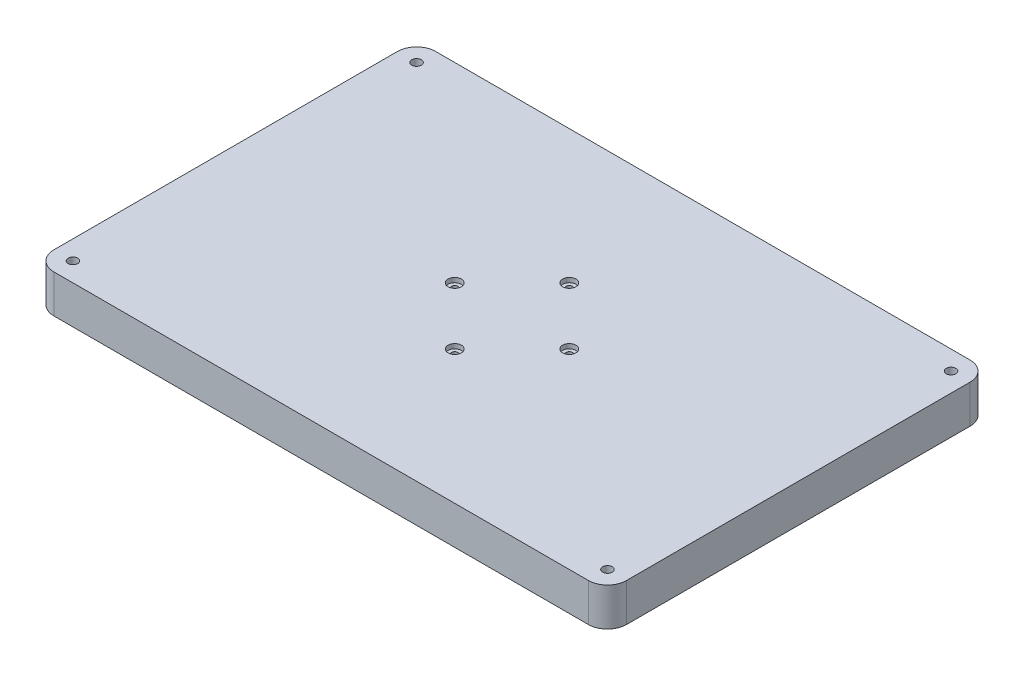
ISO-10303-21;
HEADER;
FILE_DESCRIPTION(('STEP AP214'),'2;1');
FILE_NAME('part.step','',(''),(''),'','','');
FILE_SCHEMA(('AUTOMOTIVE_DESIGN { 1 0 10303 214 1 1 1 1 }'));
ENDSEC;
DATA;
#1=APPLICATION_CONTEXT('core data for automotive mechanical design processes');
#2=APPLICATION_PROTOCOL_DEFINITION('international standard','automotive_design',2000,#1);
#3=PRODUCT_CONTEXT('',#1,'mechanical');
#4=PRODUCT('Part','Part','',(#3));
#5=PRODUCT_RELATED_PRODUCT_CATEGORY('part','',(#4));
#6=PRODUCT_DEFINITION_FORMATION('','',#4);
#7=PRODUCT_DEFINITION_CONTEXT('part definition',#1,'design');
#8=PRODUCT_DEFINITION('design','',#6,#7);
#9=PRODUCT_DEFINITION_SHAPE('','',#8);
#10=(LENGTH_UNIT() NAMED_UNIT(*) SI_UNIT(.MILLI.,.METRE.));
#11=(NAMED_UNIT(*) PLANE_ANGLE_UNIT() SI_UNIT($,.RADIAN.));
#12=(NAMED_UNIT(*) SI_UNIT($,.STERADIAN.) SOLID_ANGLE_UNIT());
#13=UNCERTAINTY_MEASURE_WITH_UNIT(LENGTH_MEASURE(1.E-05),#10,'distance_accuracy_value','');
#14=(GEOMETRIC_REPRESENTATION_CONTEXT(3) GLOBAL_UNCERTAINTY_ASSIGNED_CONTEXT((#13)) GLOBAL_UNIT_ASSIGNED_CONTEXT((#10,
#11,#12)) REPRESENTATION_CONTEXT('',''));
#15=CARTESIAN_POINT('',(0.,0.,0.));
#16=DIRECTION('',(0.,0.,1.));
#17=DIRECTION('',(1.,0.,0.));
#18=AXIS2_PLACEMENT_3D('',#15,#16,#17);
#19=CARTESIAN_POINT('',(-150.,20.,-100.));
#20=DIRECTION('',(1.,0.,0.));
#21=DIRECTION('',(0.,0.,-1.));
#22=AXIS2_PLACEMENT_3D('',#19,#20,#21);
#23=PLANE('',#22);
#24=DIRECTION('',(0.,0.,1.));
#25=VECTOR('',#24,1.);
#26=CARTESIAN_POINT('',(-150.,20.,-100.));
#27=LINE('',#26,#25);
#28=CARTESIAN_POINT('',(-150.,20.,-90.));
#29=VERTEX_POINT('',#28);
#30=CARTESIAN_POINT('',(-150.,20.,90.));
#31=VERTEX_POINT('',#30);
#32=EDGE_CURVE('E217',#29,#31,#27,.T.);
#33=ORIENTED_EDGE('',*,*,#32,.F.);
#34=DIRECTION('',(0.,-1.,0.));
#35=VECTOR('',#34,1.);
#36=CARTESIAN_POINT('',(-150.,20.,-90.));
#37=LINE('',#36,#35);
#38=CARTESIAN_POINT('',(-150.,0.,-90.));
#39=VERTEX_POINT('',#38);
#40=EDGE_CURVE('E239',#29,#39,#37,.T.);
#41=ORIENTED_EDGE('',*,*,#40,.T.);
#42=DIRECTION('',(0.,0.,1.));
#43=VECTOR('',#42,1.);
#44=CARTESIAN_POINT('',(-150.,0.,-100.));
#45=LINE('',#44,#43);
#46=CARTESIAN_POINT('',(-150.,0.,90.));
#47=VERTEX_POINT('',#46);
#48=EDGE_CURVE('E216',#39,#47,#45,.T.);
#49=ORIENTED_EDGE('',*,*,#48,.T.);
#50=DIRECTION('',(0.,-1.,0.));
#51=VECTOR('',#50,1.);
#52=CARTESIAN_POINT('',(-150.,20.,90.));
#53=LINE('',#52,#51);
#54=EDGE_CURVE('E228',#47,#31,#53,.F.);
#55=ORIENTED_EDGE('',*,*,#54,.T.);
#56=EDGE_LOOP('',(#33,#41,#49,#55));
#57=FACE_BOUND('',#56,.T.);
#58=ADVANCED_FACE('F35',(#57),#23,.F.);
#59=CARTESIAN_POINT('',(150.,20.,100.));
#60=DIRECTION('',(0.,0.,-1.));
#61=DIRECTION('',(-1.,0.,0.));
#62=AXIS2_PLACEMENT_3D('',#59,#60,#61);
#63=PLANE('',#62);
#64=DIRECTION('',(1.,0.,0.));
#65=VECTOR('',#64,1.);
#66=CARTESIAN_POINT('',(150.,20.,100.));
#67=LINE('',#66,#65);
#68=CARTESIAN_POINT('',(-140.,20.,100.));
#69=VERTEX_POINT('',#68);
#70=CARTESIAN_POINT('',(140.,20.,100.));
#71=VERTEX_POINT('',#70);
#72=EDGE_CURVE('E220',#69,#71,#67,.T.);
#73=ORIENTED_EDGE('',*,*,#72,.F.);
#74=DIRECTION('',(0.,-1.,0.));
#75=VECTOR('',#74,1.);
#76=CARTESIAN_POINT('',(-140.,20.,100.));
#77=LINE('',#76,#75);
#78=CARTESIAN_POINT('',(-140.,0.,100.));
#79=VERTEX_POINT('',#78);
#80=EDGE_CURVE('E264',#69,#79,#77,.T.);
#81=ORIENTED_EDGE('',*,*,#80,.T.);
#82=DIRECTION('',(1.,0.,0.));
#83=VECTOR('',#82,1.);
#84=CARTESIAN_POINT('',(150.,0.,100.));
#85=LINE('',#84,#83);
#86=CARTESIAN_POINT('',(140.,0.,100.));
#87=VERTEX_POINT('',#86);
#88=EDGE_CURVE('E231',#79,#87,#85,.T.);
#89=ORIENTED_EDGE('',*,*,#88,.T.);
#90=DIRECTION('',(0.,-1.,0.));
#91=VECTOR('',#90,1.);
#92=CARTESIAN_POINT('',(140.,20.,100.));
#93=LINE('',#92,#91);
#94=EDGE_CURVE('E262',#87,#71,#93,.F.);
#95=ORIENTED_EDGE('',*,*,#94,.T.);
#96=EDGE_LOOP('',(#73,#81,#89,#95));
#97=FACE_BOUND('',#96,.T.);
#98=ADVANCED_FACE('F270',(#97),#63,.F.);
#99=CARTESIAN_POINT('',(150.,20.,-100.));
#100=DIRECTION('',(-1.,0.,0.));
#101=DIRECTION('',(0.,0.,1.));
#102=AXIS2_PLACEMENT_3D('',#99,#100,#101);
#103=PLANE('',#102);
#104=DIRECTION('',(0.,0.,-1.));
#105=VECTOR('',#104,1.);
#106=CARTESIAN_POINT('',(150.,20.,-100.));
#107=LINE('',#106,#105);
#108=CARTESIAN_POINT('',(150.,20.,90.));
#109=VERTEX_POINT('',#108);
#110=CARTESIAN_POINT('',(150.,20.,-90.));
#111=VERTEX_POINT('',#110);
#112=EDGE_CURVE('E223',#109,#111,#107,.T.);
#113=ORIENTED_EDGE('',*,*,#112,.F.);
#114=DIRECTION('',(0.,-1.,0.));
#115=VECTOR('',#114,1.);
#116=CARTESIAN_POINT('',(150.,20.,90.));
#117=LINE('',#116,#115);
#118=CARTESIAN_POINT('',(150.,0.,90.));
#119=VERTEX_POINT('',#118);
#120=EDGE_CURVE('E11',#109,#119,#117,.T.);
#121=ORIENTED_EDGE('',*,*,#120,.T.);
#122=DIRECTION('',(0.,0.,-1.));
#123=VECTOR('',#122,1.);
#124=CARTESIAN_POINT('',(150.,0.,-100.));
#125=LINE('',#124,#123);
#126=CARTESIAN_POINT('',(150.,0.,-90.));
#127=VERTEX_POINT('',#126);
#128=EDGE_CURVE('E234',#119,#127,#125,.T.);
#129=ORIENTED_EDGE('',*,*,#128,.T.);
#130=DIRECTION('',(0.,-1.,0.));
#131=VECTOR('',#130,1.);
#132=CARTESIAN_POINT('',(150.,20.,-90.));
#133=LINE('',#132,#131);
#134=EDGE_CURVE('E43',#127,#111,#133,.F.);
#135=ORIENTED_EDGE('',*,*,#134,.T.);
#136=EDGE_LOOP('',(#113,#121,#129,#135));
#137=FACE_BOUND('',#136,.T.);
#138=ADVANCED_FACE('F281',(#137),#103,.F.);
#139=CARTESIAN_POINT('',(150.,20.,-100.));
#140=DIRECTION('',(0.,0.,1.));
#141=DIRECTION('',(1.,0.,0.));
#142=AXIS2_PLACEMENT_3D('',#139,#140,#141);
#143=PLANE('',#142);
#144=DIRECTION('',(-1.,0.,0.));
#145=VECTOR('',#144,1.);
#146=CARTESIAN_POINT('',(150.,0.,-100.));
#147=LINE('',#146,#145);
#148=CARTESIAN_POINT('',(140.,0.,-100.));
#149=VERTEX_POINT('',#148);
#150=CARTESIAN_POINT('',(-140.,0.,-100.));
#151=VERTEX_POINT('',#150);
#152=EDGE_CURVE('E221',#149,#151,#147,.T.);
#153=ORIENTED_EDGE('',*,*,#152,.T.);
#154=DIRECTION('',(0.,-1.,0.));
#155=VECTOR('',#154,1.);
#156=CARTESIAN_POINT('',(-140.,20.,-100.));
#157=LINE('',#156,#155);
#158=CARTESIAN_POINT('',(-140.,20.,-100.));
#159=VERTEX_POINT('',#158);
#160=EDGE_CURVE('E253',#151,#159,#157,.F.);
#161=ORIENTED_EDGE('',*,*,#160,.T.);
#162=DIRECTION('',(-1.,0.,0.));
#163=VECTOR('',#162,1.);
#164=CARTESIAN_POINT('',(150.,20.,-100.));
#165=LINE('',#164,#163);
#166=CARTESIAN_POINT('',(140.,20.,-100.));
#167=VERTEX_POINT('',#166);
#168=EDGE_CURVE('E225',#167,#159,#165,.T.);
#169=ORIENTED_EDGE('',*,*,#168,.F.);
#170=DIRECTION('',(0.,-1.,0.));
#171=VECTOR('',#170,1.);
#172=CARTESIAN_POINT('',(140.,20.,-100.));
#173=LINE('',#172,#171);
#174=EDGE_CURVE('E250',#167,#149,#173,.T.);
#175=ORIENTED_EDGE('',*,*,#174,.T.);
#176=EDGE_LOOP('',(#153,#161,#169,#175));
#177=FACE_BOUND('',#176,.T.);
#178=ADVANCED_FACE('F289',(#177),#143,.F.);
#179=CARTESIAN_POINT('',(0.,20.,0.));
#180=DIRECTION('',(0.,-1.,0.));
#181=DIRECTION('',(0.,0.,-1.));
#182=AXIS2_PLACEMENT_3D('',#179,#180,#181);
#183=PLANE('',#182);
#184=CARTESIAN_POINT('',(-140.,20.,-90.));
#185=DIRECTION('',(0.,1.,0.));
#186=DIRECTION('',(0.,0.,1.));
#187=AXIS2_PLACEMENT_3D('',#184,#185,#186);
#188=CIRCLE('',#187,2.5);
#189=CARTESIAN_POINT('',(-140.,20.,-87.5));
#190=VERTEX_POINT('',#189);
#191=EDGE_CURVE('E144',#190,#190,#188,.T.);
#192=ORIENTED_EDGE('',*,*,#191,.F.);
#193=EDGE_LOOP('',(#192));
#194=FACE_BOUND('',#193,.T.);
#195=CARTESIAN_POINT('',(140.,20.,-90.));
#196=DIRECTION('',(0.,1.,0.));
#197=DIRECTION('',(0.,0.,1.));
#198=AXIS2_PLACEMENT_3D('',#195,#196,#197);
#199=CIRCLE('',#198,2.5);
#200=CARTESIAN_POINT('',(140.,20.,-87.5));
#201=VERTEX_POINT('',#200);
#202=EDGE_CURVE('E150',#201,#201,#199,.T.);
#203=ORIENTED_EDGE('',*,*,#202,.F.);
#204=EDGE_LOOP('',(#203));
#205=FACE_BOUND('',#204,.T.);
#206=CARTESIAN_POINT('',(140.,20.,90.));
#207=DIRECTION('',(0.,1.,0.));
#208=DIRECTION('',(0.,0.,1.));
#209=AXIS2_PLACEMENT_3D('',#206,#207,#208);
#210=CIRCLE('',#209,2.5);
#211=CARTESIAN_POINT('',(140.,20.,92.5));
#212=VERTEX_POINT('',#211);
#213=EDGE_CURVE('E156',#212,#212,#210,.T.);
#214=ORIENTED_EDGE('',*,*,#213,.F.);
#215=EDGE_LOOP('',(#214));
#216=FACE_BOUND('',#215,.T.);
#217=CARTESIAN_POINT('',(-140.,20.,90.));
#218=DIRECTION('',(0.,1.,0.));
#219=DIRECTION('',(0.,0.,1.));
#220=AXIS2_PLACEMENT_3D('',#217,#218,#219);
#221=CIRCLE('',#220,2.5);
#222=CARTESIAN_POINT('',(-140.,20.,92.5));
#223=VERTEX_POINT('',#222);
#224=EDGE_CURVE('E162',#223,#223,#221,.T.);
#225=ORIENTED_EDGE('',*,*,#224,.F.);
#226=EDGE_LOOP('',(#225));
#227=FACE_BOUND('',#226,.T.);
#228=CARTESIAN_POINT('',(-30.,20.,0.));
#229=DIRECTION('',(0.,1.,0.));
#230=DIRECTION('',(0.,0.,1.));
#231=AXIS2_PLACEMENT_3D('',#228,#229,#230);
#232=CIRCLE('',#231,3.5);
#233=CARTESIAN_POINT('',(-30.,20.,3.5));
#234=VERTEX_POINT('',#233);
#235=EDGE_CURVE('E168',#234,#234,#232,.T.);
#236=ORIENTED_EDGE('',*,*,#235,.F.);
#237=EDGE_LOOP('',(#236));
#238=FACE_BOUND('',#237,.T.);
#239=CARTESIAN_POINT('',(0.,20.,30.));
#240=DIRECTION('',(0.,1.,0.));
#241=DIRECTION('',(0.,0.,1.));
#242=AXIS2_PLACEMENT_3D('',#239,#240,#241);
#243=CIRCLE('',#242,3.5);
#244=CARTESIAN_POINT('',(0.,20.,33.5));
#245=VERTEX_POINT('',#244);
#246=EDGE_CURVE('E180',#245,#245,#243,.T.);
#247=ORIENTED_EDGE('',*,*,#246,.F.);
#248=EDGE_LOOP('',(#247));
#249=FACE_BOUND('',#248,.T.);
#250=CARTESIAN_POINT('',(30.,20.,0.));
#251=DIRECTION('',(0.,1.,0.));
#252=DIRECTION('',(0.,0.,1.));
#253=AXIS2_PLACEMENT_3D('',#250,#251,#252);
#254=CIRCLE('',#253,3.5);
#255=CARTESIAN_POINT('',(30.,20.,3.5));
#256=VERTEX_POINT('',#255);
#257=EDGE_CURVE('E192',#256,#256,#254,.T.);
#258=ORIENTED_EDGE('',*,*,#257,.F.);
#259=EDGE_LOOP('',(#258));
#260=FACE_BOUND('',#259,.T.);
#261=CARTESIAN_POINT('',(0.,20.,-30.));
#262=DIRECTION('',(0.,1.,0.));
#263=DIRECTION('',(0.,0.,1.));
#264=AXIS2_PLACEMENT_3D('',#261,#262,#263);
#265=CIRCLE('',#264,3.5);
#266=CARTESIAN_POINT('',(0.,20.,-26.5));
#267=VERTEX_POINT('',#266);
#268=EDGE_CURVE('E204',#267,#267,#265,.T.);
#269=ORIENTED_EDGE('',*,*,#268,.F.);
#270=EDGE_LOOP('',(#269));
#271=FACE_BOUND('',#270,.T.);
#272=ORIENTED_EDGE('',*,*,#168,.T.);
#273=CARTESIAN_POINT('',(-140.,20.,-90.));
#274=DIRECTION('',(0.,-1.,0.));
#275=DIRECTION('',(0.,0.,-1.));
#276=AXIS2_PLACEMENT_3D('',#273,#274,#275);
#277=CIRCLE('',#276,10.);
#278=EDGE_CURVE('E260',#159,#29,#277,.F.);
#279=ORIENTED_EDGE('',*,*,#278,.T.);
#280=ORIENTED_EDGE('',*,*,#32,.T.);
#281=CARTESIAN_POINT('',(-140.,20.,90.));
#282=DIRECTION('',(0.,-1.,0.));
#283=DIRECTION('',(0.,0.,-1.));
#284=AXIS2_PLACEMENT_3D('',#281,#282,#283);
#285=CIRCLE('',#284,10.);
#286=EDGE_CURVE('E258',#31,#69,#285,.F.);
#287=ORIENTED_EDGE('',*,*,#286,.T.);
#288=ORIENTED_EDGE('',*,*,#72,.T.);
#289=CARTESIAN_POINT('',(140.,20.,90.));
#290=DIRECTION('',(0.,-1.,0.));
#291=DIRECTION('',(0.,0.,-1.));
#292=AXIS2_PLACEMENT_3D('',#289,#290,#291);
#293=CIRCLE('',#292,10.);
#294=EDGE_CURVE('E56',#71,#109,#293,.F.);
#295=ORIENTED_EDGE('',*,*,#294,.T.);
#296=ORIENTED_EDGE('',*,*,#112,.T.);
#297=CARTESIAN_POINT('',(140.,20.,-90.));
#298=DIRECTION('',(0.,-1.,0.));
#299=DIRECTION('',(0.,0.,-1.));
#300=AXIS2_PLACEMENT_3D('',#297,#298,#299);
#301=CIRCLE('',#300,10.);
#302=EDGE_CURVE('E255',#111,#167,#301,.F.);
#303=ORIENTED_EDGE('',*,*,#302,.T.);
#304=EDGE_LOOP('',(#272,#279,#280,#287,#288,#295,#296,#303));
#305=FACE_BOUND('',#304,.T.);
#306=ADVANCED_FACE('F283',(#194,#205,#216,#227,#238,#249,#260,#271,#305),#183,.F.);
#307=CARTESIAN_POINT('',(0.,0.,0.));
#308=DIRECTION('',(0.,-1.,0.));
#309=DIRECTION('',(0.,0.,-1.));
#310=AXIS2_PLACEMENT_3D('',#307,#308,#309);
#311=PLANE('',#310);
#312=CARTESIAN_POINT('',(-129.008456627389,0.,60.2814178710673));
#313=DIRECTION('',(0.,-1.,0.));
#314=DIRECTION('',(0.,0.,-1.));
#315=AXIS2_PLACEMENT_3D('',#312,#313,#314);
#316=CIRCLE('',#315,1.);
#317=CARTESIAN_POINT('',(-129.008456627389,0.,59.2814178710673));
#318=VERTEX_POINT('',#317);
#319=EDGE_CURVE('E122',#318,#318,#316,.T.);
#320=ORIENTED_EDGE('',*,*,#319,.F.);
#321=EDGE_LOOP('',(#320));
#322=FACE_BOUND('',#321,.T.);
#323=CARTESIAN_POINT('',(-123.889747091653,0.,7.88324220922874));
#324=DIRECTION('',(0.,-1.,0.));
#325=DIRECTION('',(0.,0.,-1.));
#326=AXIS2_PLACEMENT_3D('',#323,#324,#325);
#327=CIRCLE('',#326,1.);
#328=CARTESIAN_POINT('',(-123.889747091653,0.,6.88324220922874));
#329=VERTEX_POINT('',#328);
#330=EDGE_CURVE('E121',#329,#329,#327,.T.);
#331=ORIENTED_EDGE('',*,*,#330,.F.);
#332=EDGE_LOOP('',(#331));
#333=FACE_BOUND('',#332,.T.);
#334=CARTESIAN_POINT('',(-95.9897488701489,0.,7.89320413894884));
#335=DIRECTION('',(0.,-1.,0.));
#336=DIRECTION('',(0.,0.,-1.));
#337=AXIS2_PLACEMENT_3D('',#334,#335,#336);
#338=CIRCLE('',#337,1.);
#339=CARTESIAN_POINT('',(-95.9897488701489,0.,6.89320413894884));
#340=VERTEX_POINT('',#339);
#341=EDGE_CURVE('E132',#340,#340,#338,.T.);
#342=ORIENTED_EDGE('',*,*,#341,.F.);
#343=EDGE_LOOP('',(#342));
#344=FACE_BOUND('',#343,.T.);
#345=CARTESIAN_POINT('',(-80.7078884128285,0.,58.6986638944022));
#346=DIRECTION('',(0.,-1.,0.));
#347=DIRECTION('',(0.,0.,-1.));
#348=AXIS2_PLACEMENT_3D('',#345,#346,#347);
#349=CIRCLE('',#348,1.);
#350=CARTESIAN_POINT('',(-80.7078884128285,0.,57.6986638944022));
#351=VERTEX_POINT('',#350);
#352=EDGE_CURVE('E138',#351,#351,#349,.T.);
#353=ORIENTED_EDGE('',*,*,#352,.F.);
#354=EDGE_LOOP('',(#353));
#355=FACE_BOUND('',#354,.T.);
#356=CARTESIAN_POINT('',(-140.,0.,-90.));
#357=DIRECTION('',(0.,1.,0.));
#358=DIRECTION('',(0.,0.,1.));
#359=AXIS2_PLACEMENT_3D('',#356,#357,#358);
#360=CIRCLE('',#359,2.5);
#361=CARTESIAN_POINT('',(-140.,0.,-87.5));
#362=VERTEX_POINT('',#361);
#363=EDGE_CURVE('E147',#362,#362,#360,.T.);
#364=ORIENTED_EDGE('',*,*,#363,.T.);
#365=EDGE_LOOP('',(#364));
#366=FACE_BOUND('',#365,.T.);
#367=CARTESIAN_POINT('',(140.,0.,-90.));
#368=DIRECTION('',(0.,1.,0.));
#369=DIRECTION('',(0.,0.,1.));
#370=AXIS2_PLACEMENT_3D('',#367,#368,#369);
#371=CIRCLE('',#370,2.5);
#372=CARTESIAN_POINT('',(140.,0.,-87.5));
#373=VERTEX_POINT('',#372);
#374=EDGE_CURVE('E153',#373,#373,#371,.T.);
#375=ORIENTED_EDGE('',*,*,#374,.T.);
#376=EDGE_LOOP('',(#375));
#377=FACE_BOUND('',#376,.T.);
#378=CARTESIAN_POINT('',(140.,0.,90.));
#379=DIRECTION('',(0.,1.,0.));
#380=DIRECTION('',(0.,0.,1.));
#381=AXIS2_PLACEMENT_3D('',#378,#379,#380);
#382=CIRCLE('',#381,2.5);
#383=CARTESIAN_POINT('',(140.,0.,92.5));
#384=VERTEX_POINT('',#383);
#385=EDGE_CURVE('E159',#384,#384,#382,.T.);
#386=ORIENTED_EDGE('',*,*,#385,.T.);
#387=EDGE_LOOP('',(#386));
#388=FACE_BOUND('',#387,.T.);
#389=CARTESIAN_POINT('',(-140.,0.,90.));
#390=DIRECTION('',(0.,1.,0.));
#391=DIRECTION('',(0.,0.,1.));
#392=AXIS2_PLACEMENT_3D('',#389,#390,#391);
#393=CIRCLE('',#392,2.5);
#394=CARTESIAN_POINT('',(-140.,0.,92.5));
#395=VERTEX_POINT('',#394);
#396=EDGE_CURVE('E165',#395,#395,#393,.T.);
#397=ORIENTED_EDGE('',*,*,#396,.T.);
#398=EDGE_LOOP('',(#397));
#399=FACE_BOUND('',#398,.T.);
#400=CARTESIAN_POINT('',(-30.,0.,0.));
#401=DIRECTION('',(0.,1.,0.));
#402=DIRECTION('',(0.,0.,1.));
#403=AXIS2_PLACEMENT_3D('',#400,#401,#402);
#404=CIRCLE('',#403,1.69999999999999);
#405=CARTESIAN_POINT('',(-30.,0.,1.69999999999999));
#406=VERTEX_POINT('',#405);
#407=EDGE_CURVE('E177',#406,#406,#404,.T.);
#408=ORIENTED_EDGE('',*,*,#407,.T.);
#409=EDGE_LOOP('',(#408));
#410=FACE_BOUND('',#409,.T.);
#411=CARTESIAN_POINT('',(0.,0.,30.));
#412=DIRECTION('',(0.,1.,0.));
#413=DIRECTION('',(0.,0.,1.));
#414=AXIS2_PLACEMENT_3D('',#411,#412,#413);
#415=CIRCLE('',#414,1.69999999999999);
#416=CARTESIAN_POINT('',(0.,0.,31.7));
#417=VERTEX_POINT('',#416);
#418=EDGE_CURVE('E189',#417,#417,#415,.T.);
#419=ORIENTED_EDGE('',*,*,#418,.T.);
#420=EDGE_LOOP('',(#419));
#421=FACE_BOUND('',#420,.T.);
#422=CARTESIAN_POINT('',(30.,0.,0.));
#423=DIRECTION('',(0.,1.,0.));
#424=DIRECTION('',(0.,0.,1.));
#425=AXIS2_PLACEMENT_3D('',#422,#423,#424);
#426=CIRCLE('',#425,1.69999999999999);
#427=CARTESIAN_POINT('',(30.,0.,1.69999999999999));
#428=VERTEX_POINT('',#427);
#429=EDGE_CURVE('E201',#428,#428,#426,.T.);
#430=ORIENTED_EDGE('',*,*,#429,.T.);
#431=EDGE_LOOP('',(#430));
#432=FACE_BOUND('',#431,.T.);
#433=CARTESIAN_POINT('',(0.,0.,-30.));
#434=DIRECTION('',(0.,1.,0.));
#435=DIRECTION('',(0.,0.,1.));
#436=AXIS2_PLACEMENT_3D('',#433,#434,#435);
#437=CIRCLE('',#436,1.69999999999999);
#438=CARTESIAN_POINT('',(0.,0.,-28.3));
#439=VERTEX_POINT('',#438);
#440=EDGE_CURVE('E213',#439,#439,#437,.T.);
#441=ORIENTED_EDGE('',*,*,#440,.T.);
#442=EDGE_LOOP('',(#441));
#443=FACE_BOUND('',#442,.T.);
#444=ORIENTED_EDGE('',*,*,#48,.F.);
#445=CARTESIAN_POINT('',(-140.,0.,-90.));
#446=DIRECTION('',(0.,-1.,0.));
#447=DIRECTION('',(0.,0.,-1.));
#448=AXIS2_PLACEMENT_3D('',#445,#446,#447);
#449=CIRCLE('',#448,10.);
#450=EDGE_CURVE('E248',#39,#151,#449,.T.);
#451=ORIENTED_EDGE('',*,*,#450,.T.);
#452=ORIENTED_EDGE('',*,*,#152,.F.);
#453=CARTESIAN_POINT('',(140.,0.,-90.));
#454=DIRECTION('',(0.,-1.,0.));
#455=DIRECTION('',(0.,0.,-1.));
#456=AXIS2_PLACEMENT_3D('',#453,#454,#455);
#457=CIRCLE('',#456,10.);
#458=EDGE_CURVE('E242',#149,#127,#457,.T.);
#459=ORIENTED_EDGE('',*,*,#458,.T.);
#460=ORIENTED_EDGE('',*,*,#128,.F.);
#461=CARTESIAN_POINT('',(140.,0.,90.));
#462=DIRECTION('',(0.,-1.,0.));
#463=DIRECTION('',(0.,0.,-1.));
#464=AXIS2_PLACEMENT_3D('',#461,#462,#463);
#465=CIRCLE('',#464,10.);
#466=EDGE_CURVE('E244',#119,#87,#465,.T.);
#467=ORIENTED_EDGE('',*,*,#466,.T.);
#468=ORIENTED_EDGE('',*,*,#88,.F.);
#469=CARTESIAN_POINT('',(-140.,0.,90.));
#470=DIRECTION('',(0.,-1.,0.));
#471=DIRECTION('',(0.,0.,-1.));
#472=AXIS2_PLACEMENT_3D('',#469,#470,#471);
#473=CIRCLE('',#472,10.);
#474=EDGE_CURVE('E246',#79,#47,#473,.T.);
#475=ORIENTED_EDGE('',*,*,#474,.T.);
#476=EDGE_LOOP('',(#444,#451,#452,#459,#460,#467,#468,#475));
#477=FACE_BOUND('',#476,.T.);
#478=ADVANCED_FACE('F276',(#322,#333,#344,#355,#366,#377,#388,#399,#410,#421,#432,#443,#477),
#311,.T.);
#479=CARTESIAN_POINT('',(-140.,20.,-90.));
#480=DIRECTION('',(0.,-1.,0.));
#481=DIRECTION('',(0.,0.,-1.));
#482=AXIS2_PLACEMENT_3D('',#479,#480,#481);
#483=CYLINDRICAL_SURFACE('',#482,10.);
#484=ORIENTED_EDGE('',*,*,#278,.F.);
#485=ORIENTED_EDGE('',*,*,#160,.F.);
#486=ORIENTED_EDGE('',*,*,#450,.F.);
#487=ORIENTED_EDGE('',*,*,#40,.F.);
#488=EDGE_LOOP('',(#484,#485,#486,#487));
#489=FACE_BOUND('',#488,.T.);
#490=ADVANCED_FACE('F294',(#489),#483,.T.);
#491=CARTESIAN_POINT('',(-140.,20.,90.));
#492=DIRECTION('',(0.,-1.,0.));
#493=DIRECTION('',(0.,0.,-1.));
#494=AXIS2_PLACEMENT_3D('',#491,#492,#493);
#495=CYLINDRICAL_SURFACE('',#494,10.);
#496=ORIENTED_EDGE('',*,*,#286,.F.);
#497=ORIENTED_EDGE('',*,*,#54,.F.);
#498=ORIENTED_EDGE('',*,*,#474,.F.);
#499=ORIENTED_EDGE('',*,*,#80,.F.);
#500=EDGE_LOOP('',(#496,#497,#498,#499));
#501=FACE_BOUND('',#500,.T.);
#502=ADVANCED_FACE('F298',(#501),#495,.T.);
#503=CARTESIAN_POINT('',(140.,20.,90.));
#504=DIRECTION('',(0.,-1.,0.));
#505=DIRECTION('',(0.,0.,-1.));
#506=AXIS2_PLACEMENT_3D('',#503,#504,#505);
#507=CYLINDRICAL_SURFACE('',#506,10.);
#508=ORIENTED_EDGE('',*,*,#294,.F.);
#509=ORIENTED_EDGE('',*,*,#94,.F.);
#510=ORIENTED_EDGE('',*,*,#466,.F.);
#511=ORIENTED_EDGE('',*,*,#120,.F.);
#512=EDGE_LOOP('',(#508,#509,#510,#511));
#513=FACE_BOUND('',#512,.T.);
#514=ADVANCED_FACE('F280',(#513),#507,.T.);
#515=CARTESIAN_POINT('',(140.,20.,-90.));
#516=DIRECTION('',(0.,-1.,0.));
#517=DIRECTION('',(0.,0.,-1.));
#518=AXIS2_PLACEMENT_3D('',#515,#516,#517);
#519=CYLINDRICAL_SURFACE('',#518,10.);
#520=ORIENTED_EDGE('',*,*,#302,.F.);
#521=ORIENTED_EDGE('',*,*,#134,.F.);
#522=ORIENTED_EDGE('',*,*,#458,.F.);
#523=ORIENTED_EDGE('',*,*,#174,.F.);
#524=EDGE_LOOP('',(#520,#521,#522,#523));
#525=FACE_BOUND('',#524,.T.);
#526=ADVANCED_FACE('F37',(#525),#519,.T.);
#527=CARTESIAN_POINT('',(0.,20.,-30.));
#528=DIRECTION('',(0.,1.,0.));
#529=DIRECTION('',(0.,0.,1.));
#530=AXIS2_PLACEMENT_3D('',#527,#528,#529);
#531=CYLINDRICAL_SURFACE('',#530,1.7);
#532=ORIENTED_EDGE('',*,*,#440,.F.);
#533=EDGE_LOOP('',(#532));
#534=FACE_BOUND('',#533,.T.);
#535=CARTESIAN_POINT('',(0.,17.6,-30.));
#536=DIRECTION('',(0.,1.,0.));
#537=DIRECTION('',(0.,0.,1.));
#538=AXIS2_PLACEMENT_3D('',#535,#536,#537);
#539=CIRCLE('',#538,1.7);
#540=CARTESIAN_POINT('',(0.,17.6,-28.3));
#541=VERTEX_POINT('',#540);
#542=EDGE_CURVE('E210',#541,#541,#539,.T.);
#543=ORIENTED_EDGE('',*,*,#542,.T.);
#544=EDGE_LOOP('',(#543));
#545=FACE_BOUND('',#544,.T.);
#546=ADVANCED_FACE('F323',(#534,#545),#531,.F.);
#547=CARTESIAN_POINT('',(1.7,17.6,-30.));
#548=DIRECTION('',(0.,-1.,0.));
#549=DIRECTION('',(0.,0.,-1.));
#550=AXIS2_PLACEMENT_3D('',#547,#548,#549);
#551=PLANE('',#550);
#552=ORIENTED_EDGE('',*,*,#542,.F.);
#553=EDGE_LOOP('',(#552));
#554=FACE_BOUND('',#553,.T.);
#555=CARTESIAN_POINT('',(0.,17.6,-30.));
#556=DIRECTION('',(0.,1.,0.));
#557=DIRECTION('',(0.,0.,1.));
#558=AXIS2_PLACEMENT_3D('',#555,#556,#557);
#559=CIRCLE('',#558,3.5);
#560=CARTESIAN_POINT('',(0.,17.6,-26.5));
#561=VERTEX_POINT('',#560);
#562=EDGE_CURVE('E207',#561,#561,#559,.T.);
#563=ORIENTED_EDGE('',*,*,#562,.T.);
#564=EDGE_LOOP('',(#563));
#565=FACE_BOUND('',#564,.T.);
#566=ADVANCED_FACE('F326',(#554,#565),#551,.F.);
#567=CARTESIAN_POINT('',(0.,20.,-30.));
#568=DIRECTION('',(0.,1.,0.));
#569=DIRECTION('',(0.,0.,1.));
#570=AXIS2_PLACEMENT_3D('',#567,#568,#569);
#571=CYLINDRICAL_SURFACE('',#570,3.5);
#572=ORIENTED_EDGE('',*,*,#562,.F.);
#573=EDGE_LOOP('',(#572));
#574=FACE_BOUND('',#573,.T.);
#575=ORIENTED_EDGE('',*,*,#268,.T.);
#576=EDGE_LOOP('',(#575));
#577=FACE_BOUND('',#576,.T.);
#578=ADVANCED_FACE('F330',(#574,#577),#571,.F.);
#579=CARTESIAN_POINT('',(30.,20.,0.));
#580=DIRECTION('',(0.,1.,0.));
#581=DIRECTION('',(0.,0.,1.));
#582=AXIS2_PLACEMENT_3D('',#579,#580,#581);
#583=CYLINDRICAL_SURFACE('',#582,1.7);
#584=ORIENTED_EDGE('',*,*,#429,.F.);
#585=EDGE_LOOP('',(#584));
#586=FACE_BOUND('',#585,.T.);
#587=CARTESIAN_POINT('',(30.,17.6,0.));
#588=DIRECTION('',(0.,1.,0.));
#589=DIRECTION('',(0.,0.,1.));
#590=AXIS2_PLACEMENT_3D('',#587,#588,#589);
#591=CIRCLE('',#590,1.7);
#592=CARTESIAN_POINT('',(30.,17.6,1.7));
#593=VERTEX_POINT('',#592);
#594=EDGE_CURVE('E198',#593,#593,#591,.T.);
#595=ORIENTED_EDGE('',*,*,#594,.T.);
#596=EDGE_LOOP('',(#595));
#597=FACE_BOUND('',#596,.T.);
#598=ADVANCED_FACE('F334',(#586,#597),#583,.F.);
#599=CARTESIAN_POINT('',(31.7,17.6,0.));
#600=DIRECTION('',(0.,-1.,0.));
#601=DIRECTION('',(0.,0.,-1.));
#602=AXIS2_PLACEMENT_3D('',#599,#600,#601);
#603=PLANE('',#602);
#604=ORIENTED_EDGE('',*,*,#594,.F.);
#605=EDGE_LOOP('',(#604));
#606=FACE_BOUND('',#605,.T.);
#607=CARTESIAN_POINT('',(30.,17.6,0.));
#608=DIRECTION('',(0.,1.,0.));
#609=DIRECTION('',(0.,0.,1.));
#610=AXIS2_PLACEMENT_3D('',#607,#608,#609);
#611=CIRCLE('',#610,3.5);
#612=CARTESIAN_POINT('',(30.,17.6,3.5));
#613=VERTEX_POINT('',#612);
#614=EDGE_CURVE('E195',#613,#613,#611,.T.);
#615=ORIENTED_EDGE('',*,*,#614,.T.);
#616=EDGE_LOOP('',(#615));
#617=FACE_BOUND('',#616,.T.);
#618=ADVANCED_FACE('F338',(#606,#617),#603,.F.);
#619=CARTESIAN_POINT('',(30.,20.,0.));
#620=DIRECTION('',(0.,1.,0.));
#621=DIRECTION('',(0.,0.,1.));
#622=AXIS2_PLACEMENT_3D('',#619,#620,#621);
#623=CYLINDRICAL_SURFACE('',#622,3.5);
#624=ORIENTED_EDGE('',*,*,#614,.F.);
#625=EDGE_LOOP('',(#624));
#626=FACE_BOUND('',#625,.T.);
#627=ORIENTED_EDGE('',*,*,#257,.T.);
#628=EDGE_LOOP('',(#627));
#629=FACE_BOUND('',#628,.T.);
#630=ADVANCED_FACE('F342',(#626,#629),#623,.F.);
#631=CARTESIAN_POINT('',(0.,20.,30.));
#632=DIRECTION('',(0.,1.,0.));
#633=DIRECTION('',(0.,0.,1.));
#634=AXIS2_PLACEMENT_3D('',#631,#632,#633);
#635=CYLINDRICAL_SURFACE('',#634,1.7);
#636=ORIENTED_EDGE('',*,*,#418,.F.);
#637=EDGE_LOOP('',(#636));
#638=FACE_BOUND('',#637,.T.);
#639=CARTESIAN_POINT('',(0.,17.6,30.));
#640=DIRECTION('',(0.,1.,0.));
#641=DIRECTION('',(0.,0.,1.));
#642=AXIS2_PLACEMENT_3D('',#639,#640,#641);
#643=CIRCLE('',#642,1.7);
#644=CARTESIAN_POINT('',(0.,17.6,31.7));
#645=VERTEX_POINT('',#644);
#646=EDGE_CURVE('E186',#645,#645,#643,.T.);
#647=ORIENTED_EDGE('',*,*,#646,.T.);
#648=EDGE_LOOP('',(#647));
#649=FACE_BOUND('',#648,.T.);
#650=ADVANCED_FACE('F346',(#638,#649),#635,.F.);
#651=CARTESIAN_POINT('',(1.7,17.6,30.));
#652=DIRECTION('',(0.,-1.,0.));
#653=DIRECTION('',(0.,0.,-1.));
#654=AXIS2_PLACEMENT_3D('',#651,#652,#653);
#655=PLANE('',#654);
#656=ORIENTED_EDGE('',*,*,#646,.F.);
#657=EDGE_LOOP('',(#656));
#658=FACE_BOUND('',#657,.T.);
#659=CARTESIAN_POINT('',(0.,17.6,30.));
#660=DIRECTION('',(0.,1.,0.));
#661=DIRECTION('',(0.,0.,1.));
#662=AXIS2_PLACEMENT_3D('',#659,#660,#661);
#663=CIRCLE('',#662,3.5);
#664=CARTESIAN_POINT('',(0.,17.6,33.5));
#665=VERTEX_POINT('',#664);
#666=EDGE_CURVE('E183',#665,#665,#663,.T.);
#667=ORIENTED_EDGE('',*,*,#666,.T.);
#668=EDGE_LOOP('',(#667));
#669=FACE_BOUND('',#668,.T.);
#670=ADVANCED_FACE('F350',(#658,#669),#655,.F.);
#671=CARTESIAN_POINT('',(0.,20.,30.));
#672=DIRECTION('',(0.,1.,0.));
#673=DIRECTION('',(0.,0.,1.));
#674=AXIS2_PLACEMENT_3D('',#671,#672,#673);
#675=CYLINDRICAL_SURFACE('',#674,3.5);
#676=ORIENTED_EDGE('',*,*,#666,.F.);
#677=EDGE_LOOP('',(#676));
#678=FACE_BOUND('',#677,.T.);
#679=ORIENTED_EDGE('',*,*,#246,.T.);
#680=EDGE_LOOP('',(#679));
#681=FACE_BOUND('',#680,.T.);
#682=ADVANCED_FACE('F354',(#678,#681),#675,.F.);
#683=CARTESIAN_POINT('',(-30.,20.,0.));
#684=DIRECTION('',(0.,1.,0.));
#685=DIRECTION('',(0.,0.,1.));
#686=AXIS2_PLACEMENT_3D('',#683,#684,#685);
#687=CYLINDRICAL_SURFACE('',#686,1.7);
#688=ORIENTED_EDGE('',*,*,#407,.F.);
#689=EDGE_LOOP('',(#688));
#690=FACE_BOUND('',#689,.T.);
#691=CARTESIAN_POINT('',(-30.,17.6,0.));
#692=DIRECTION('',(0.,1.,0.));
#693=DIRECTION('',(0.,0.,1.));
#694=AXIS2_PLACEMENT_3D('',#691,#692,#693);
#695=CIRCLE('',#694,1.7);
#696=CARTESIAN_POINT('',(-30.,17.6,1.7));
#697=VERTEX_POINT('',#696);
#698=EDGE_CURVE('E174',#697,#697,#695,.T.);
#699=ORIENTED_EDGE('',*,*,#698,.T.);
#700=EDGE_LOOP('',(#699));
#701=FACE_BOUND('',#700,.T.);
#702=ADVANCED_FACE('F358',(#690,#701),#687,.F.);
#703=CARTESIAN_POINT('',(-28.3,17.6,0.));
#704=DIRECTION('',(0.,-1.,0.));
#705=DIRECTION('',(0.,0.,-1.));
#706=AXIS2_PLACEMENT_3D('',#703,#704,#705);
#707=PLANE('',#706);
#708=ORIENTED_EDGE('',*,*,#698,.F.);
#709=EDGE_LOOP('',(#708));
#710=FACE_BOUND('',#709,.T.);
#711=CARTESIAN_POINT('',(-30.,17.6,0.));
#712=DIRECTION('',(0.,1.,0.));
#713=DIRECTION('',(0.,0.,1.));
#714=AXIS2_PLACEMENT_3D('',#711,#712,#713);
#715=CIRCLE('',#714,3.5);
#716=CARTESIAN_POINT('',(-30.,17.6,3.5));
#717=VERTEX_POINT('',#716);
#718=EDGE_CURVE('E171',#717,#717,#715,.T.);
#719=ORIENTED_EDGE('',*,*,#718,.T.);
#720=EDGE_LOOP('',(#719));
#721=FACE_BOUND('',#720,.T.);
#722=ADVANCED_FACE('F362',(#710,#721),#707,.F.);
#723=CARTESIAN_POINT('',(-30.,20.,0.));
#724=DIRECTION('',(0.,1.,0.));
#725=DIRECTION('',(0.,0.,1.));
#726=AXIS2_PLACEMENT_3D('',#723,#724,#725);
#727=CYLINDRICAL_SURFACE('',#726,3.5);
#728=ORIENTED_EDGE('',*,*,#718,.F.);
#729=EDGE_LOOP('',(#728));
#730=FACE_BOUND('',#729,.T.);
#731=ORIENTED_EDGE('',*,*,#235,.T.);
#732=EDGE_LOOP('',(#731));
#733=FACE_BOUND('',#732,.T.);
#734=ADVANCED_FACE('F366',(#730,#733),#727,.F.);
#735=CARTESIAN_POINT('',(-140.,20.,90.));
#736=DIRECTION('',(0.,1.,0.));
#737=DIRECTION('',(0.,0.,1.));
#738=AXIS2_PLACEMENT_3D('',#735,#736,#737);
#739=CYLINDRICAL_SURFACE('',#738,2.5);
#740=ORIENTED_EDGE('',*,*,#396,.F.);
#741=EDGE_LOOP('',(#740));
#742=FACE_BOUND('',#741,.T.);
#743=ORIENTED_EDGE('',*,*,#224,.T.);
#744=EDGE_LOOP('',(#743));
#745=FACE_BOUND('',#744,.T.);
#746=ADVANCED_FACE('F370',(#742,#745),#739,.F.);
#747=CARTESIAN_POINT('',(140.,20.,90.));
#748=DIRECTION('',(0.,1.,0.));
#749=DIRECTION('',(0.,0.,1.));
#750=AXIS2_PLACEMENT_3D('',#747,#748,#749);
#751=CYLINDRICAL_SURFACE('',#750,2.5);
#752=ORIENTED_EDGE('',*,*,#385,.F.);
#753=EDGE_LOOP('',(#752));
#754=FACE_BOUND('',#753,.T.);
#755=ORIENTED_EDGE('',*,*,#213,.T.);
#756=EDGE_LOOP('',(#755));
#757=FACE_BOUND('',#756,.T.);
#758=ADVANCED_FACE('F374',(#754,#757),#751,.F.);
#759=CARTESIAN_POINT('',(140.,20.,-90.));
#760=DIRECTION('',(0.,1.,0.));
#761=DIRECTION('',(0.,0.,1.));
#762=AXIS2_PLACEMENT_3D('',#759,#760,#761);
#763=CYLINDRICAL_SURFACE('',#762,2.5);
#764=ORIENTED_EDGE('',*,*,#374,.F.);
#765=EDGE_LOOP('',(#764));
#766=FACE_BOUND('',#765,.T.);
#767=ORIENTED_EDGE('',*,*,#202,.T.);
#768=EDGE_LOOP('',(#767));
#769=FACE_BOUND('',#768,.T.);
#770=ADVANCED_FACE('F378',(#766,#769),#763,.F.);
#771=CARTESIAN_POINT('',(-140.,20.,-90.));
#772=DIRECTION('',(0.,1.,0.));
#773=DIRECTION('',(0.,0.,1.));
#774=AXIS2_PLACEMENT_3D('',#771,#772,#773);
#775=CYLINDRICAL_SURFACE('',#774,2.5);
#776=ORIENTED_EDGE('',*,*,#363,.F.);
#777=EDGE_LOOP('',(#776));
#778=FACE_BOUND('',#777,.T.);
#779=ORIENTED_EDGE('',*,*,#191,.T.);
#780=EDGE_LOOP('',(#779));
#781=FACE_BOUND('',#780,.T.);
#782=ADVANCED_FACE('F382',(#778,#781),#775,.F.);
#783=CARTESIAN_POINT('',(-80.7078884128285,10.,58.6986638944022));
#784=DIRECTION('',(0.,-1.,0.));
#785=DIRECTION('',(0.,0.,-1.));
#786=AXIS2_PLACEMENT_3D('',#783,#784,#785);
#787=CONICAL_SURFACE('',#786,1.,1.02974425867665);
#788=CARTESIAN_POINT('',(-80.7078884128285,10.6008606190276,58.6986638944022));
#789=VERTEX_POINT('',#788);
#790=VERTEX_LOOP('',#789);
#791=FACE_BOUND('',#790,.T.);
#792=CARTESIAN_POINT('',(-80.7078884128285,10.,58.6986638944022));
#793=DIRECTION('',(0.,-1.,0.));
#794=DIRECTION('',(0.,0.,-1.));
#795=AXIS2_PLACEMENT_3D('',#792,#793,#794);
#796=CIRCLE('',#795,1.);
#797=CARTESIAN_POINT('',(-80.7078884128285,10.,57.6986638944022));
#798=VERTEX_POINT('',#797);
#799=EDGE_CURVE('E141',#798,#798,#796,.T.);
#800=ORIENTED_EDGE('',*,*,#799,.T.);
#801=EDGE_LOOP('',(#800));
#802=FACE_BOUND('',#801,.T.);
#803=ADVANCED_FACE('F386',(#791,#802),#787,.F.);
#804=CARTESIAN_POINT('',(-80.7078884128285,0.,58.6986638944022));
#805=DIRECTION('',(0.,-1.,0.));
#806=DIRECTION('',(0.,0.,-1.));
#807=AXIS2_PLACEMENT_3D('',#804,#805,#806);
#808=CYLINDRICAL_SURFACE('',#807,1.);
#809=ORIENTED_EDGE('',*,*,#799,.F.);
#810=EDGE_LOOP('',(#809));
#811=FACE_BOUND('',#810,.T.);
#812=ORIENTED_EDGE('',*,*,#352,.T.);
#813=EDGE_LOOP('',(#812));
#814=FACE_BOUND('',#813,.T.);
#815=ADVANCED_FACE('F390',(#811,#814),#808,.F.);
#816=CARTESIAN_POINT('',(-95.9897488701489,10.,7.89320413894884));
#817=DIRECTION('',(0.,-1.,0.));
#818=DIRECTION('',(0.,0.,-1.));
#819=AXIS2_PLACEMENT_3D('',#816,#817,#818);
#820=CONICAL_SURFACE('',#819,1.,1.02974425867665);
#821=CARTESIAN_POINT('',(-95.9897488701489,10.6008606190276,7.89320413894884));
#822=VERTEX_POINT('',#821);
#823=VERTEX_LOOP('',#822);
#824=FACE_BOUND('',#823,.T.);
#825=CARTESIAN_POINT('',(-95.9897488701489,10.,7.89320413894884));
#826=DIRECTION('',(0.,-1.,0.));
#827=DIRECTION('',(0.,0.,-1.));
#828=AXIS2_PLACEMENT_3D('',#825,#826,#827);
#829=CIRCLE('',#828,1.);
#830=CARTESIAN_POINT('',(-95.9897488701489,10.,6.89320413894884));
#831=VERTEX_POINT('',#830);
#832=EDGE_CURVE('E135',#831,#831,#829,.T.);
#833=ORIENTED_EDGE('',*,*,#832,.T.);
#834=EDGE_LOOP('',(#833));
#835=FACE_BOUND('',#834,.T.);
#836=ADVANCED_FACE('F394',(#824,#835),#820,.F.);
#837=CARTESIAN_POINT('',(-95.9897488701489,0.,7.89320413894884));
#838=DIRECTION('',(0.,-1.,0.));
#839=DIRECTION('',(0.,0.,-1.));
#840=AXIS2_PLACEMENT_3D('',#837,#838,#839);
#841=CYLINDRICAL_SURFACE('',#840,1.);
#842=ORIENTED_EDGE('',*,*,#832,.F.);
#843=EDGE_LOOP('',(#842));
#844=FACE_BOUND('',#843,.T.);
#845=ORIENTED_EDGE('',*,*,#341,.T.);
#846=EDGE_LOOP('',(#845));
#847=FACE_BOUND('',#846,.T.);
#848=ADVANCED_FACE('F398',(#844,#847),#841,.F.);
#849=CARTESIAN_POINT('',(-123.889747091653,10.,7.88324220922874));
#850=DIRECTION('',(0.,-1.,0.));
#851=DIRECTION('',(0.,0.,-1.));
#852=AXIS2_PLACEMENT_3D('',#849,#850,#851);
#853=CONICAL_SURFACE('',#852,1.,1.02974425867665);
#854=CARTESIAN_POINT('',(-123.889747091653,10.6008606190276,7.88324220922874));
#855=VERTEX_POINT('',#854);
#856=VERTEX_LOOP('',#855);
#857=FACE_BOUND('',#856,.T.);
#858=CARTESIAN_POINT('',(-123.889747091653,10.,7.88324220922874));
#859=DIRECTION('',(0.,-1.,0.));
#860=DIRECTION('',(0.,0.,-1.));
#861=AXIS2_PLACEMENT_3D('',#858,#859,#860);
#862=CIRCLE('',#861,1.);
#863=CARTESIAN_POINT('',(-123.889747091653,10.,6.88324220922874));
#864=VERTEX_POINT('',#863);
#865=EDGE_CURVE('E125',#864,#864,#862,.T.);
#866=ORIENTED_EDGE('',*,*,#865,.T.);
#867=EDGE_LOOP('',(#866));
#868=FACE_BOUND('',#867,.T.);
#869=ADVANCED_FACE('F402',(#857,#868),#853,.F.);
#870=CARTESIAN_POINT('',(-123.889747091653,0.,7.88324220922874));
#871=DIRECTION('',(0.,-1.,0.));
#872=DIRECTION('',(0.,0.,-1.));
#873=AXIS2_PLACEMENT_3D('',#870,#871,#872);
#874=CYLINDRICAL_SURFACE('',#873,1.);
#875=ORIENTED_EDGE('',*,*,#865,.F.);
#876=EDGE_LOOP('',(#875));
#877=FACE_BOUND('',#876,.T.);
#878=ORIENTED_EDGE('',*,*,#330,.T.);
#879=EDGE_LOOP('',(#878));
#880=FACE_BOUND('',#879,.T.);
#881=ADVANCED_FACE('F115',(#877,#880),#874,.F.);
#882=CARTESIAN_POINT('',(-129.008456627389,10.,60.2814178710673));
#883=DIRECTION('',(0.,-1.,0.));
#884=DIRECTION('',(0.,0.,-1.));
#885=AXIS2_PLACEMENT_3D('',#882,#883,#884);
#886=CONICAL_SURFACE('',#885,1.,1.02974425867665);
#887=CARTESIAN_POINT('',(-129.008456627389,10.6008606190276,60.2814178710673));
#888=VERTEX_POINT('',#887);
#889=VERTEX_LOOP('',#888);
#890=FACE_BOUND('',#889,.T.);
#891=CARTESIAN_POINT('',(-129.008456627389,10.,60.2814178710673));
#892=DIRECTION('',(0.,-1.,0.));
#893=DIRECTION('',(0.,0.,-1.));
#894=AXIS2_PLACEMENT_3D('',#891,#892,#893);
#895=CIRCLE('',#894,1.);
#896=CARTESIAN_POINT('',(-129.008456627389,10.,59.2814178710673));
#897=VERTEX_POINT('',#896);
#898=EDGE_CURVE('E119',#897,#897,#895,.T.);
#899=ORIENTED_EDGE('',*,*,#898,.T.);
#900=EDGE_LOOP('',(#899));
#901=FACE_BOUND('',#900,.T.);
#902=ADVANCED_FACE('F111',(#890,#901),#886,.F.);
#903=CARTESIAN_POINT('',(-129.008456627389,0.,60.2814178710673));
#904=DIRECTION('',(0.,-1.,0.));
#905=DIRECTION('',(0.,0.,-1.));
#906=AXIS2_PLACEMENT_3D('',#903,#904,#905);
#907=CYLINDRICAL_SURFACE('',#906,1.);
#908=ORIENTED_EDGE('',*,*,#898,.F.);
#909=EDGE_LOOP('',(#908));
#910=FACE_BOUND('',#909,.T.);
#911=ORIENTED_EDGE('',*,*,#319,.T.);
#912=EDGE_LOOP('',(#911));
#913=FACE_BOUND('',#912,.T.);
#914=ADVANCED_FACE('F114',(#910,#913),#907,.F.);
#915=CLOSED_SHELL('',(#58,#98,#138,#178,#306,#478,#490,#502,#514,#526,#546,#566,#578,#598,#618,
#630,#650,#670,#682,#702,#722,#734,#746,#758,#770,#782,#803,#815,#836,#848,#869,#881,#902,#914));
#916=MANIFOLD_SOLID_BREP('B2',#915);
#917=ADVANCED_BREP_SHAPE_REPRESENTATION('',(#18,#916),#14);
#918=SHAPE_DEFINITION_REPRESENTATION(#9,#917);
ENDSEC;
END-ISO-10303-21;
